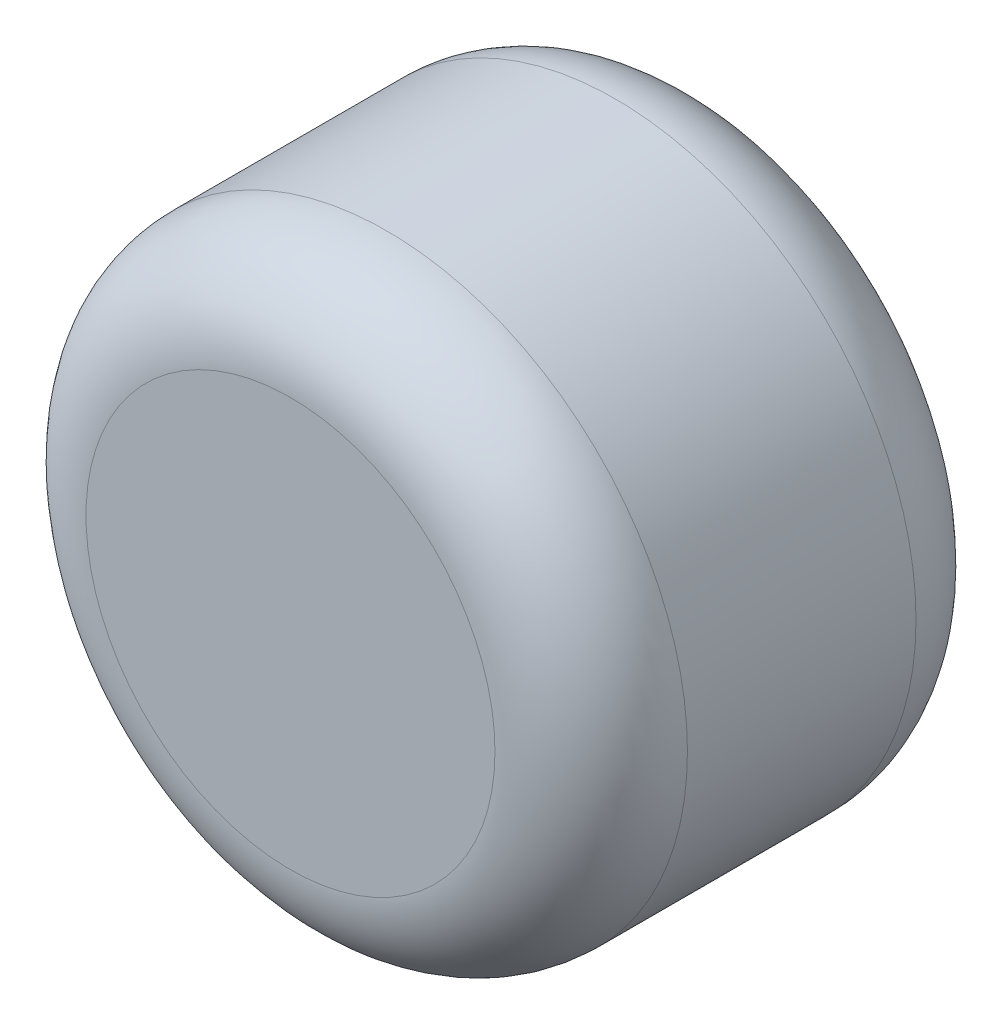
ISO-10303-21;
HEADER;
FILE_DESCRIPTION(('STEP AP214'),'2;1');
FILE_NAME('part.step','',(''),(''),'','','');
FILE_SCHEMA(('AUTOMOTIVE_DESIGN { 1 0 10303 214 1 1 1 1 }'));
ENDSEC;
DATA;
#1=APPLICATION_CONTEXT('core data for automotive mechanical design processes');
#2=APPLICATION_PROTOCOL_DEFINITION('international standard','automotive_design',2000,#1);
#3=PRODUCT_CONTEXT('',#1,'mechanical');
#4=PRODUCT('Part','Part','',(#3));
#5=PRODUCT_RELATED_PRODUCT_CATEGORY('part','',(#4));
#6=PRODUCT_DEFINITION_FORMATION('','',#4);
#7=PRODUCT_DEFINITION_CONTEXT('part definition',#1,'design');
#8=PRODUCT_DEFINITION('design','',#6,#7);
#9=PRODUCT_DEFINITION_SHAPE('','',#8);
#10=(LENGTH_UNIT() NAMED_UNIT(*) SI_UNIT(.MILLI.,.METRE.));
#11=(NAMED_UNIT(*) PLANE_ANGLE_UNIT() SI_UNIT($,.RADIAN.));
#12=(NAMED_UNIT(*) SI_UNIT($,.STERADIAN.) SOLID_ANGLE_UNIT());
#13=UNCERTAINTY_MEASURE_WITH_UNIT(LENGTH_MEASURE(1.E-05),#10,'distance_accuracy_value','');
#14=(GEOMETRIC_REPRESENTATION_CONTEXT(3) GLOBAL_UNCERTAINTY_ASSIGNED_CONTEXT((#13)) GLOBAL_UNIT_ASSIGNED_CONTEXT((#10,
#11,#12)) REPRESENTATION_CONTEXT('',''));
#15=CARTESIAN_POINT('',(0.,0.,0.));
#16=DIRECTION('',(0.,0.,1.));
#17=DIRECTION('',(1.,0.,0.));
#18=AXIS2_PLACEMENT_3D('',#15,#16,#17);
#19=CARTESIAN_POINT('',(0.,0.,44.45));
#20=DIRECTION('',(0.,0.,-1.));
#21=DIRECTION('',(-1.,0.,0.));
#22=AXIS2_PLACEMENT_3D('',#19,#20,#21);
#23=CYLINDRICAL_SURFACE('',#22,63.5);
#24=CARTESIAN_POINT('',(0.,0.,-24.13));
#25=DIRECTION('',(0.,0.,1.));
#26=DIRECTION('',(1.,0.,0.));
#27=AXIS2_PLACEMENT_3D('',#24,#25,#26);
#28=CIRCLE('',#27,63.5);
#29=CARTESIAN_POINT('',(63.5,0.,-24.13));
#30=VERTEX_POINT('',#29);
#31=EDGE_CURVE('E45',#30,#30,#28,.T.);
#32=ORIENTED_EDGE('',*,*,#31,.T.);
#33=EDGE_LOOP('',(#32));
#34=FACE_BOUND('',#33,.T.);
#35=CARTESIAN_POINT('',(0.,0.,24.13));
#36=DIRECTION('',(0.,0.,1.));
#37=DIRECTION('',(1.,0.,0.));
#38=AXIS2_PLACEMENT_3D('',#35,#36,#37);
#39=CIRCLE('',#38,63.5);
#40=CARTESIAN_POINT('',(63.5,0.,24.13));
#41=VERTEX_POINT('',#40);
#42=EDGE_CURVE('E49',#41,#41,#39,.F.);
#43=ORIENTED_EDGE('',*,*,#42,.T.);
#44=EDGE_LOOP('',(#43));
#45=FACE_BOUND('',#44,.T.);
#46=ADVANCED_FACE('F34',(#34,#45),#23,.T.);
#47=CARTESIAN_POINT('',(0.,0.,44.45));
#48=DIRECTION('',(0.,0.,1.));
#49=DIRECTION('',(1.,0.,0.));
#50=AXIS2_PLACEMENT_3D('',#47,#48,#49);
#51=PLANE('',#50);
#52=CARTESIAN_POINT('',(0.,0.,44.45));
#53=DIRECTION('',(0.,0.,1.));
#54=DIRECTION('',(1.,0.,0.));
#55=AXIS2_PLACEMENT_3D('',#52,#53,#54);
#56=CIRCLE('',#55,43.18);
#57=CARTESIAN_POINT('',(43.18,0.,44.45));
#58=VERTEX_POINT('',#57);
#59=EDGE_CURVE('E10',#58,#58,#56,.T.);
#60=ORIENTED_EDGE('',*,*,#59,.T.);
#61=EDGE_LOOP('',(#60));
#62=FACE_BOUND('',#61,.T.);
#63=ADVANCED_FACE('F65',(#62),#51,.T.);
#64=CARTESIAN_POINT('',(0.,0.,-44.45));
#65=DIRECTION('',(0.,0.,1.));
#66=DIRECTION('',(1.,0.,0.));
#67=AXIS2_PLACEMENT_3D('',#64,#65,#66);
#68=PLANE('',#67);
#69=CARTESIAN_POINT('',(0.,0.,-44.45));
#70=DIRECTION('',(0.,0.,1.));
#71=DIRECTION('',(1.,0.,0.));
#72=AXIS2_PLACEMENT_3D('',#69,#70,#71);
#73=CIRCLE('',#72,43.18);
#74=CARTESIAN_POINT('',(43.18,0.,-44.45));
#75=VERTEX_POINT('',#74);
#76=EDGE_CURVE('E41',#75,#75,#73,.F.);
#77=ORIENTED_EDGE('',*,*,#76,.T.);
#78=EDGE_LOOP('',(#77));
#79=FACE_BOUND('',#78,.T.);
#80=ADVANCED_FACE('F62',(#79),#68,.F.);
#81=CARTESIAN_POINT('',(0.,0.,-24.13));
#82=DIRECTION('',(0.,0.,1.));
#83=DIRECTION('',(1.,0.,0.));
#84=AXIS2_PLACEMENT_3D('',#81,#82,#83);
#85=TOROIDAL_SURFACE('',#84,43.18,20.32);
#86=ORIENTED_EDGE('',*,*,#76,.F.);
#87=EDGE_LOOP('',(#86));
#88=FACE_BOUND('',#87,.T.);
#89=ORIENTED_EDGE('',*,*,#31,.F.);
#90=EDGE_LOOP('',(#89));
#91=FACE_BOUND('',#90,.T.);
#92=ADVANCED_FACE('F58',(#88,#91),#85,.T.);
#93=CARTESIAN_POINT('',(0.,0.,24.13));
#94=DIRECTION('',(0.,0.,1.));
#95=DIRECTION('',(1.,0.,0.));
#96=AXIS2_PLACEMENT_3D('',#93,#94,#95);
#97=TOROIDAL_SURFACE('',#96,43.18,20.32);
#98=ORIENTED_EDGE('',*,*,#42,.F.);
#99=EDGE_LOOP('',(#98));
#100=FACE_BOUND('',#99,.T.);
#101=ORIENTED_EDGE('',*,*,#59,.F.);
#102=EDGE_LOOP('',(#101));
#103=FACE_BOUND('',#102,.T.);
#104=ADVANCED_FACE('F36',(#100,#103),#97,.T.);
#105=CLOSED_SHELL('',(#46,#63,#80,#92,#104));
#106=MANIFOLD_SOLID_BREP('B2',#105);
#107=ADVANCED_BREP_SHAPE_REPRESENTATION('',(#18,#106),#14);
#108=SHAPE_DEFINITION_REPRESENTATION(#9,#107);
ENDSEC;
END-ISO-10303-21;
